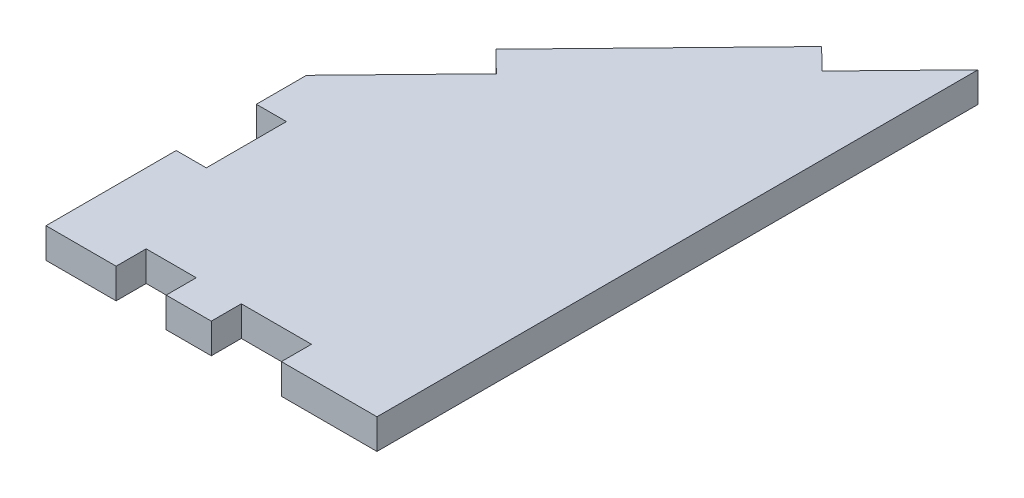
ISO-10303-21;
HEADER;
FILE_DESCRIPTION(('STEP AP214'),'2;1');
FILE_NAME('part.step','',(''),(''),'','','');
FILE_SCHEMA(('AUTOMOTIVE_DESIGN { 1 0 10303 214 1 1 1 1 }'));
ENDSEC;
DATA;
#1=APPLICATION_CONTEXT('core data for automotive mechanical design processes');
#2=APPLICATION_PROTOCOL_DEFINITION('international standard','automotive_design',2000,#1);
#3=PRODUCT_CONTEXT('',#1,'mechanical');
#4=PRODUCT('Part','Part','',(#3));
#5=PRODUCT_RELATED_PRODUCT_CATEGORY('part','',(#4));
#6=PRODUCT_DEFINITION_FORMATION('','',#4);
#7=PRODUCT_DEFINITION_CONTEXT('part definition',#1,'design');
#8=PRODUCT_DEFINITION('design','',#6,#7);
#9=PRODUCT_DEFINITION_SHAPE('','',#8);
#10=(LENGTH_UNIT() NAMED_UNIT(*) SI_UNIT(.MILLI.,.METRE.));
#11=(NAMED_UNIT(*) PLANE_ANGLE_UNIT() SI_UNIT($,.RADIAN.));
#12=(NAMED_UNIT(*) SI_UNIT($,.STERADIAN.) SOLID_ANGLE_UNIT());
#13=UNCERTAINTY_MEASURE_WITH_UNIT(LENGTH_MEASURE(1.E-05),#10,'distance_accuracy_value','');
#14=(GEOMETRIC_REPRESENTATION_CONTEXT(3) GLOBAL_UNCERTAINTY_ASSIGNED_CONTEXT((#13)) GLOBAL_UNIT_ASSIGNED_CONTEXT((#10,
#11,#12)) REPRESENTATION_CONTEXT('',''));
#15=CARTESIAN_POINT('',(0.,0.,0.));
#16=DIRECTION('',(0.,0.,1.));
#17=DIRECTION('',(1.,0.,0.));
#18=AXIS2_PLACEMENT_3D('',#15,#16,#17);
#19=CARTESIAN_POINT('',(1571.17156296441,3.,4124.17356938647));
#20=DIRECTION('',(1.,0.,0.));
#21=DIRECTION('',(0.,0.,-1.));
#22=AXIS2_PLACEMENT_3D('',#19,#20,#21);
#23=PLANE('',#22);
#24=DIRECTION('',(0.,0.,1.));
#25=VECTOR('',#24,1.);
#26=CARTESIAN_POINT('',(1571.17156296441,0.,4124.17356938647));
#27=LINE('',#26,#25);
#28=CARTESIAN_POINT('',(1571.17156296441,0.,4124.17356938647));
#29=VERTEX_POINT('',#28);
#30=CARTESIAN_POINT('',(1571.17156296441,0.,4137.17356938647));
#31=VERTEX_POINT('',#30);
#32=EDGE_CURVE('E200',#29,#31,#27,.T.);
#33=ORIENTED_EDGE('',*,*,#32,.T.);
#34=DIRECTION('',(0.,-1.,0.));
#35=VECTOR('',#34,1.);
#36=CARTESIAN_POINT('',(1571.17156296441,3.,4137.17356938647));
#37=LINE('',#36,#35);
#38=CARTESIAN_POINT('',(1571.17156296441,3.,4137.17356938647));
#39=VERTEX_POINT('',#38);
#40=EDGE_CURVE('E11',#39,#31,#37,.T.);
#41=ORIENTED_EDGE('',*,*,#40,.F.);
#42=DIRECTION('',(0.,0.,1.));
#43=VECTOR('',#42,1.);
#44=CARTESIAN_POINT('',(1571.17156296441,3.,4124.17356938647));
#45=LINE('',#44,#43);
#46=CARTESIAN_POINT('',(1571.17156296441,3.,4124.17356938647));
#47=VERTEX_POINT('',#46);
#48=EDGE_CURVE('E238',#47,#39,#45,.T.);
#49=ORIENTED_EDGE('',*,*,#48,.F.);
#50=DIRECTION('',(0.,-1.,0.));
#51=VECTOR('',#50,1.);
#52=CARTESIAN_POINT('',(1571.17156296441,3.,4124.17356938647));
#53=LINE('',#52,#51);
#54=EDGE_CURVE('E196',#47,#29,#53,.T.);
#55=ORIENTED_EDGE('',*,*,#54,.T.);
#56=EDGE_LOOP('',(#33,#41,#49,#55));
#57=FACE_BOUND('',#56,.T.);
#58=ADVANCED_FACE('F32',(#57),#23,.F.);
#59=CARTESIAN_POINT('',(1571.17156296441,3.,4137.17356938647));
#60=DIRECTION('',(0.,0.,-1.));
#61=DIRECTION('',(-1.,0.,0.));
#62=AXIS2_PLACEMENT_3D('',#59,#60,#61);
#63=PLANE('',#62);
#64=DIRECTION('',(1.,0.,0.));
#65=VECTOR('',#64,1.);
#66=CARTESIAN_POINT('',(1571.17156296441,0.,4137.17356938647));
#67=LINE('',#66,#65);
#68=CARTESIAN_POINT('',(1578.17156296441,0.,4137.17356938647));
#69=VERTEX_POINT('',#68);
#70=EDGE_CURVE('E203',#31,#69,#67,.T.);
#71=ORIENTED_EDGE('',*,*,#70,.T.);
#72=DIRECTION('',(0.,-1.,0.));
#73=VECTOR('',#72,1.);
#74=CARTESIAN_POINT('',(1578.17156296441,3.,4137.17356938647));
#75=LINE('',#74,#73);
#76=CARTESIAN_POINT('',(1578.17156296441,3.,4137.17356938647));
#77=VERTEX_POINT('',#76);
#78=EDGE_CURVE('E40',#77,#69,#75,.T.);
#79=ORIENTED_EDGE('',*,*,#78,.F.);
#80=DIRECTION('',(1.,0.,0.));
#81=VECTOR('',#80,1.);
#82=CARTESIAN_POINT('',(1571.17156296441,3.,4137.17356938647));
#83=LINE('',#82,#81);
#84=EDGE_CURVE('E127',#39,#77,#83,.T.);
#85=ORIENTED_EDGE('',*,*,#84,.F.);
#86=ORIENTED_EDGE('',*,*,#40,.T.);
#87=EDGE_LOOP('',(#71,#79,#85,#86));
#88=FACE_BOUND('',#87,.T.);
#89=ADVANCED_FACE('F356',(#88),#63,.F.);
#90=CARTESIAN_POINT('',(1578.17156296441,3.,4137.17356938647));
#91=DIRECTION('',(-1.,0.,0.));
#92=DIRECTION('',(0.,0.,1.));
#93=AXIS2_PLACEMENT_3D('',#90,#91,#92);
#94=PLANE('',#93);
#95=DIRECTION('',(0.,0.,-1.));
#96=VECTOR('',#95,1.);
#97=CARTESIAN_POINT('',(1578.17156296441,0.,4137.17356938647));
#98=LINE('',#97,#96);
#99=CARTESIAN_POINT('',(1578.17156296441,0.,4134.17356938647));
#100=VERTEX_POINT('',#99);
#101=EDGE_CURVE('E205',#69,#100,#98,.T.);
#102=ORIENTED_EDGE('',*,*,#101,.T.);
#103=DIRECTION('',(0.,-1.,0.));
#104=VECTOR('',#103,1.);
#105=CARTESIAN_POINT('',(1578.17156296441,3.,4134.17356938647));
#106=LINE('',#105,#104);
#107=CARTESIAN_POINT('',(1578.17156296441,3.,4134.17356938647));
#108=VERTEX_POINT('',#107);
#109=EDGE_CURVE('E281',#108,#100,#106,.T.);
#110=ORIENTED_EDGE('',*,*,#109,.F.);
#111=DIRECTION('',(0.,0.,-1.));
#112=VECTOR('',#111,1.);
#113=CARTESIAN_POINT('',(1578.17156296441,3.,4137.17356938647));
#114=LINE('',#113,#112);
#115=EDGE_CURVE('E289',#77,#108,#114,.T.);
#116=ORIENTED_EDGE('',*,*,#115,.F.);
#117=ORIENTED_EDGE('',*,*,#78,.T.);
#118=EDGE_LOOP('',(#102,#110,#116,#117));
#119=FACE_BOUND('',#118,.T.);
#120=ADVANCED_FACE('F287',(#119),#94,.F.);
#121=CARTESIAN_POINT('',(1578.17156296441,3.,4134.17356938647));
#122=DIRECTION('',(0.,0.,-1.));
#123=DIRECTION('',(-1.,0.,0.));
#124=AXIS2_PLACEMENT_3D('',#121,#122,#123);
#125=PLANE('',#124);
#126=DIRECTION('',(1.,0.,0.));
#127=VECTOR('',#126,1.);
#128=CARTESIAN_POINT('',(1578.17156296441,0.,4134.17356938647));
#129=LINE('',#128,#127);
#130=CARTESIAN_POINT('',(1583.17156296441,0.,4134.17356938647));
#131=VERTEX_POINT('',#130);
#132=EDGE_CURVE('E207',#100,#131,#129,.T.);
#133=ORIENTED_EDGE('',*,*,#132,.T.);
#134=DIRECTION('',(0.,-1.,0.));
#135=VECTOR('',#134,1.);
#136=CARTESIAN_POINT('',(1583.17156296441,3.,4134.17356938647));
#137=LINE('',#136,#135);
#138=CARTESIAN_POINT('',(1583.17156296441,3.,4134.17356938647));
#139=VERTEX_POINT('',#138);
#140=EDGE_CURVE('E278',#139,#131,#137,.T.);
#141=ORIENTED_EDGE('',*,*,#140,.F.);
#142=DIRECTION('',(1.,0.,0.));
#143=VECTOR('',#142,1.);
#144=CARTESIAN_POINT('',(1578.17156296441,3.,4134.17356938647));
#145=LINE('',#144,#143);
#146=EDGE_CURVE('E307',#108,#139,#145,.T.);
#147=ORIENTED_EDGE('',*,*,#146,.F.);
#148=ORIENTED_EDGE('',*,*,#109,.T.);
#149=EDGE_LOOP('',(#133,#141,#147,#148));
#150=FACE_BOUND('',#149,.T.);
#151=ADVANCED_FACE('F298',(#150),#125,.F.);
#152=CARTESIAN_POINT('',(1583.17156296441,3.,4134.17356938647));
#153=DIRECTION('',(1.,0.,0.));
#154=DIRECTION('',(0.,0.,-1.));
#155=AXIS2_PLACEMENT_3D('',#152,#153,#154);
#156=PLANE('',#155);
#157=DIRECTION('',(0.,0.,1.));
#158=VECTOR('',#157,1.);
#159=CARTESIAN_POINT('',(1583.17156296441,0.,4134.17356938647));
#160=LINE('',#159,#158);
#161=CARTESIAN_POINT('',(1583.17156296441,0.,4137.17356938647));
#162=VERTEX_POINT('',#161);
#163=EDGE_CURVE('E209',#131,#162,#160,.T.);
#164=ORIENTED_EDGE('',*,*,#163,.T.);
#165=DIRECTION('',(0.,-1.,0.));
#166=VECTOR('',#165,1.);
#167=CARTESIAN_POINT('',(1583.17156296441,3.,4137.17356938647));
#168=LINE('',#167,#166);
#169=CARTESIAN_POINT('',(1583.17156296441,3.,4137.17356938647));
#170=VERTEX_POINT('',#169);
#171=EDGE_CURVE('E275',#170,#162,#168,.T.);
#172=ORIENTED_EDGE('',*,*,#171,.F.);
#173=DIRECTION('',(0.,0.,1.));
#174=VECTOR('',#173,1.);
#175=CARTESIAN_POINT('',(1583.17156296441,3.,4134.17356938647));
#176=LINE('',#175,#174);
#177=EDGE_CURVE('E304',#139,#170,#176,.T.);
#178=ORIENTED_EDGE('',*,*,#177,.F.);
#179=ORIENTED_EDGE('',*,*,#140,.T.);
#180=EDGE_LOOP('',(#164,#172,#178,#179));
#181=FACE_BOUND('',#180,.T.);
#182=ADVANCED_FACE('F302',(#181),#156,.F.);
#183=CARTESIAN_POINT('',(1583.17156296441,3.,4137.17356938647));
#184=DIRECTION('',(0.,0.,-1.));
#185=DIRECTION('',(-1.,0.,0.));
#186=AXIS2_PLACEMENT_3D('',#183,#184,#185);
#187=PLANE('',#186);
#188=DIRECTION('',(1.,0.,0.));
#189=VECTOR('',#188,1.);
#190=CARTESIAN_POINT('',(1583.17156296441,0.,4137.17356938647));
#191=LINE('',#190,#189);
#192=CARTESIAN_POINT('',(1587.67156296441,0.,4137.17356938647));
#193=VERTEX_POINT('',#192);
#194=EDGE_CURVE('E211',#162,#193,#191,.T.);
#195=ORIENTED_EDGE('',*,*,#194,.T.);
#196=DIRECTION('',(0.,-1.,0.));
#197=VECTOR('',#196,1.);
#198=CARTESIAN_POINT('',(1587.67156296441,3.,4137.17356938647));
#199=LINE('',#198,#197);
#200=CARTESIAN_POINT('',(1587.67156296441,3.,4137.17356938647));
#201=VERTEX_POINT('',#200);
#202=EDGE_CURVE('E272',#201,#193,#199,.T.);
#203=ORIENTED_EDGE('',*,*,#202,.F.);
#204=DIRECTION('',(1.,0.,0.));
#205=VECTOR('',#204,1.);
#206=CARTESIAN_POINT('',(1583.17156296441,3.,4137.17356938647));
#207=LINE('',#206,#205);
#208=EDGE_CURVE('E306',#170,#201,#207,.T.);
#209=ORIENTED_EDGE('',*,*,#208,.F.);
#210=ORIENTED_EDGE('',*,*,#171,.T.);
#211=EDGE_LOOP('',(#195,#203,#209,#210));
#212=FACE_BOUND('',#211,.T.);
#213=ADVANCED_FACE('F369',(#212),#187,.F.);
#214=CARTESIAN_POINT('',(1587.67156296441,3.,4137.17356938647));
#215=DIRECTION('',(-1.,0.,0.));
#216=DIRECTION('',(0.,0.,1.));
#217=AXIS2_PLACEMENT_3D('',#214,#215,#216);
#218=PLANE('',#217);
#219=DIRECTION('',(0.,0.,-1.));
#220=VECTOR('',#219,1.);
#221=CARTESIAN_POINT('',(1587.67156296441,0.,4137.17356938647));
#222=LINE('',#221,#220);
#223=CARTESIAN_POINT('',(1587.67156296441,0.,4134.17356938647));
#224=VERTEX_POINT('',#223);
#225=EDGE_CURVE('E213',#193,#224,#222,.T.);
#226=ORIENTED_EDGE('',*,*,#225,.T.);
#227=DIRECTION('',(0.,-1.,0.));
#228=VECTOR('',#227,1.);
#229=CARTESIAN_POINT('',(1587.67156296441,3.,4134.17356938647));
#230=LINE('',#229,#228);
#231=CARTESIAN_POINT('',(1587.67156296441,3.,4134.17356938647));
#232=VERTEX_POINT('',#231);
#233=EDGE_CURVE('E269',#232,#224,#230,.T.);
#234=ORIENTED_EDGE('',*,*,#233,.F.);
#235=DIRECTION('',(0.,0.,-1.));
#236=VECTOR('',#235,1.);
#237=CARTESIAN_POINT('',(1587.67156296441,3.,4137.17356938647));
#238=LINE('',#237,#236);
#239=EDGE_CURVE('E309',#201,#232,#238,.T.);
#240=ORIENTED_EDGE('',*,*,#239,.F.);
#241=ORIENTED_EDGE('',*,*,#202,.T.);
#242=EDGE_LOOP('',(#226,#234,#240,#241));
#243=FACE_BOUND('',#242,.T.);
#244=ADVANCED_FACE('F372',(#243),#218,.F.);
#245=CARTESIAN_POINT('',(1587.67156296441,3.,4134.17356938647));
#246=DIRECTION('',(0.,0.,-1.));
#247=DIRECTION('',(-1.,0.,0.));
#248=AXIS2_PLACEMENT_3D('',#245,#246,#247);
#249=PLANE('',#248);
#250=DIRECTION('',(1.,0.,0.));
#251=VECTOR('',#250,1.);
#252=CARTESIAN_POINT('',(1587.67156296441,0.,4134.17356938647));
#253=LINE('',#252,#251);
#254=CARTESIAN_POINT('',(1594.67156296441,0.,4134.17356938647));
#255=VERTEX_POINT('',#254);
#256=EDGE_CURVE('E215',#224,#255,#253,.T.);
#257=ORIENTED_EDGE('',*,*,#256,.T.);
#258=DIRECTION('',(0.,-1.,0.));
#259=VECTOR('',#258,1.);
#260=CARTESIAN_POINT('',(1594.67156296441,3.,4134.17356938647));
#261=LINE('',#260,#259);
#262=CARTESIAN_POINT('',(1594.67156296441,3.,4134.17356938647));
#263=VERTEX_POINT('',#262);
#264=EDGE_CURVE('E266',#263,#255,#261,.T.);
#265=ORIENTED_EDGE('',*,*,#264,.F.);
#266=DIRECTION('',(1.,0.,0.));
#267=VECTOR('',#266,1.);
#268=CARTESIAN_POINT('',(1587.67156296441,3.,4134.17356938647));
#269=LINE('',#268,#267);
#270=EDGE_CURVE('E315',#232,#263,#269,.T.);
#271=ORIENTED_EDGE('',*,*,#270,.F.);
#272=ORIENTED_EDGE('',*,*,#233,.T.);
#273=EDGE_LOOP('',(#257,#265,#271,#272));
#274=FACE_BOUND('',#273,.T.);
#275=ADVANCED_FACE('F376',(#274),#249,.F.);
#276=CARTESIAN_POINT('',(1594.67156296441,3.,4134.17356938647));
#277=DIRECTION('',(1.,0.,0.));
#278=DIRECTION('',(0.,0.,-1.));
#279=AXIS2_PLACEMENT_3D('',#276,#277,#278);
#280=PLANE('',#279);
#281=DIRECTION('',(0.,0.,1.));
#282=VECTOR('',#281,1.);
#283=CARTESIAN_POINT('',(1594.67156296441,0.,4134.17356938647));
#284=LINE('',#283,#282);
#285=CARTESIAN_POINT('',(1594.67156296441,0.,4137.17356938647));
#286=VERTEX_POINT('',#285);
#287=EDGE_CURVE('E217',#255,#286,#284,.T.);
#288=ORIENTED_EDGE('',*,*,#287,.T.);
#289=DIRECTION('',(0.,-1.,0.));
#290=VECTOR('',#289,1.);
#291=CARTESIAN_POINT('',(1594.67156296441,3.,4137.17356938647));
#292=LINE('',#291,#290);
#293=CARTESIAN_POINT('',(1594.67156296441,3.,4137.17356938647));
#294=VERTEX_POINT('',#293);
#295=EDGE_CURVE('E263',#294,#286,#292,.T.);
#296=ORIENTED_EDGE('',*,*,#295,.F.);
#297=DIRECTION('',(0.,0.,1.));
#298=VECTOR('',#297,1.);
#299=CARTESIAN_POINT('',(1594.67156296441,3.,4134.17356938647));
#300=LINE('',#299,#298);
#301=EDGE_CURVE('E317',#263,#294,#300,.T.);
#302=ORIENTED_EDGE('',*,*,#301,.F.);
#303=ORIENTED_EDGE('',*,*,#264,.T.);
#304=EDGE_LOOP('',(#288,#296,#302,#303));
#305=FACE_BOUND('',#304,.T.);
#306=ADVANCED_FACE('F380',(#305),#280,.F.);
#307=CARTESIAN_POINT('',(1594.67156296441,3.,4137.17356938647));
#308=DIRECTION('',(0.,0.,-1.));
#309=DIRECTION('',(-1.,0.,0.));
#310=AXIS2_PLACEMENT_3D('',#307,#308,#309);
#311=PLANE('',#310);
#312=DIRECTION('',(1.,0.,0.));
#313=VECTOR('',#312,1.);
#314=CARTESIAN_POINT('',(1594.67156296441,0.,4137.17356938647));
#315=LINE('',#314,#313);
#316=CARTESIAN_POINT('',(1604.21156296441,0.,4137.17356938647));
#317=VERTEX_POINT('',#316);
#318=EDGE_CURVE('E219',#286,#317,#315,.T.);
#319=ORIENTED_EDGE('',*,*,#318,.T.);
#320=DIRECTION('',(0.,-1.,0.));
#321=VECTOR('',#320,1.);
#322=CARTESIAN_POINT('',(1604.21156296441,3.,4137.17356938647));
#323=LINE('',#322,#321);
#324=CARTESIAN_POINT('',(1604.21156296441,3.,4137.17356938647));
#325=VERTEX_POINT('',#324);
#326=EDGE_CURVE('E260',#325,#317,#323,.T.);
#327=ORIENTED_EDGE('',*,*,#326,.F.);
#328=DIRECTION('',(1.,0.,0.));
#329=VECTOR('',#328,1.);
#330=CARTESIAN_POINT('',(1594.67156296441,3.,4137.17356938647));
#331=LINE('',#330,#329);
#332=EDGE_CURVE('E319',#294,#325,#331,.T.);
#333=ORIENTED_EDGE('',*,*,#332,.F.);
#334=ORIENTED_EDGE('',*,*,#295,.T.);
#335=EDGE_LOOP('',(#319,#327,#333,#334));
#336=FACE_BOUND('',#335,.T.);
#337=ADVANCED_FACE('F384',(#336),#311,.F.);
#338=CARTESIAN_POINT('',(1604.21156296441,3.,4077.17356938647));
#339=DIRECTION('',(-1.,0.,0.));
#340=DIRECTION('',(0.,0.,1.));
#341=AXIS2_PLACEMENT_3D('',#338,#339,#340);
#342=PLANE('',#341);
#343=DIRECTION('',(0.,0.,-1.));
#344=VECTOR('',#343,1.);
#345=CARTESIAN_POINT('',(1604.21156296441,0.,4077.17356938647));
#346=LINE('',#345,#344);
#347=CARTESIAN_POINT('',(1604.21156296441,0.,4077.17356938647));
#348=VERTEX_POINT('',#347);
#349=EDGE_CURVE('E221',#317,#348,#346,.T.);
#350=ORIENTED_EDGE('',*,*,#349,.T.);
#351=DIRECTION('',(0.,-1.,0.));
#352=VECTOR('',#351,1.);
#353=CARTESIAN_POINT('',(1604.21156296441,3.,4077.17356938647));
#354=LINE('',#353,#352);
#355=CARTESIAN_POINT('',(1604.21156296441,3.,4077.17356938647));
#356=VERTEX_POINT('',#355);
#357=EDGE_CURVE('E257',#356,#348,#354,.T.);
#358=ORIENTED_EDGE('',*,*,#357,.F.);
#359=DIRECTION('',(0.,0.,-1.));
#360=VECTOR('',#359,1.);
#361=CARTESIAN_POINT('',(1604.21156296441,3.,4077.17356938647));
#362=LINE('',#361,#360);
#363=EDGE_CURVE('E321',#325,#356,#362,.T.);
#364=ORIENTED_EDGE('',*,*,#363,.F.);
#365=ORIENTED_EDGE('',*,*,#326,.T.);
#366=EDGE_LOOP('',(#350,#358,#364,#365));
#367=FACE_BOUND('',#366,.T.);
#368=ADVANCED_FACE('F388',(#367),#342,.F.);
#369=CARTESIAN_POINT('',(1604.21156296441,3.,4077.17356938647));
#370=DIRECTION('',(0.717158889853033,0.,0.696909697668762));
#371=DIRECTION('',(0.696909697668762,0.,-0.717158889853033));
#372=AXIS2_PLACEMENT_3D('',#369,#370,#371);
#373=PLANE('',#372);
#374=DIRECTION('',(-0.696909697668762,0.,0.717158889853033));
#375=VECTOR('',#374,1.);
#376=CARTESIAN_POINT('',(1604.21156296441,0.,4077.17356938647));
#377=LINE('',#376,#375);
#378=CARTESIAN_POINT('',(1596.54555629005,0.,4085.06231717486));
#379=VERTEX_POINT('',#378);
#380=EDGE_CURVE('E223',#348,#379,#377,.T.);
#381=ORIENTED_EDGE('',*,*,#380,.T.);
#382=DIRECTION('',(0.,-1.,0.));
#383=VECTOR('',#382,1.);
#384=CARTESIAN_POINT('',(1596.54555629005,3.,4085.06231717486));
#385=LINE('',#384,#383);
#386=CARTESIAN_POINT('',(1596.54555629005,3.,4085.06231717486));
#387=VERTEX_POINT('',#386);
#388=EDGE_CURVE('E254',#387,#379,#385,.T.);
#389=ORIENTED_EDGE('',*,*,#388,.F.);
#390=DIRECTION('',(-0.696909697668762,0.,0.717158889853033));
#391=VECTOR('',#390,1.);
#392=CARTESIAN_POINT('',(1604.21156296441,3.,4077.17356938647));
#393=LINE('',#392,#391);
#394=EDGE_CURVE('E323',#356,#387,#393,.T.);
#395=ORIENTED_EDGE('',*,*,#394,.F.);
#396=ORIENTED_EDGE('',*,*,#357,.T.);
#397=EDGE_LOOP('',(#381,#389,#395,#396));
#398=FACE_BOUND('',#397,.T.);
#399=ADVANCED_FACE('F392',(#398),#373,.F.);
#400=CARTESIAN_POINT('',(1594.39407962049,3.,4082.97158808185));
#401=DIRECTION('',(-0.69690969766887,0.,0.717158889852928));
#402=DIRECTION('',(0.717158889852928,0.,0.69690969766887));
#403=AXIS2_PLACEMENT_3D('',#400,#401,#402);
#404=PLANE('',#403);
#405=DIRECTION('',(-0.717158889852928,0.,-0.69690969766887));
#406=VECTOR('',#405,1.);
#407=CARTESIAN_POINT('',(1594.39407962049,0.,4082.97158808185));
#408=LINE('',#407,#406);
#409=CARTESIAN_POINT('',(1594.39407962049,0.,4082.97158808185));
#410=VERTEX_POINT('',#409);
#411=EDGE_CURVE('E225',#379,#410,#408,.T.);
#412=ORIENTED_EDGE('',*,*,#411,.T.);
#413=DIRECTION('',(0.,-1.,0.));
#414=VECTOR('',#413,1.);
#415=CARTESIAN_POINT('',(1594.39407962049,3.,4082.97158808185));
#416=LINE('',#415,#414);
#417=CARTESIAN_POINT('',(1594.39407962049,3.,4082.97158808185));
#418=VERTEX_POINT('',#417);
#419=EDGE_CURVE('E251',#418,#410,#416,.T.);
#420=ORIENTED_EDGE('',*,*,#419,.F.);
#421=DIRECTION('',(-0.717158889852928,0.,-0.69690969766887));
#422=VECTOR('',#421,1.);
#423=CARTESIAN_POINT('',(1594.39407962049,3.,4082.97158808185));
#424=LINE('',#423,#422);
#425=EDGE_CURVE('E325',#387,#418,#424,.T.);
#426=ORIENTED_EDGE('',*,*,#425,.F.);
#427=ORIENTED_EDGE('',*,*,#388,.T.);
#428=EDGE_LOOP('',(#412,#420,#426,#427));
#429=FACE_BOUND('',#428,.T.);
#430=ADVANCED_FACE('F396',(#429),#404,.F.);
#431=CARTESIAN_POINT('',(1578.36515657411,3.,4099.46624254847));
#432=DIRECTION('',(0.71715888985294,0.,0.696909697668858));
#433=DIRECTION('',(0.696909697668858,0.,-0.71715888985294));
#434=AXIS2_PLACEMENT_3D('',#431,#432,#433);
#435=PLANE('',#434);
#436=DIRECTION('',(-0.696909697668858,0.,0.71715888985294));
#437=VECTOR('',#436,1.);
#438=CARTESIAN_POINT('',(1578.36515657411,0.,4099.46624254847));
#439=LINE('',#438,#437);
#440=CARTESIAN_POINT('',(1578.36515657411,0.,4099.46624254847));
#441=VERTEX_POINT('',#440);
#442=EDGE_CURVE('E227',#410,#441,#439,.T.);
#443=ORIENTED_EDGE('',*,*,#442,.T.);
#444=DIRECTION('',(0.,-1.,0.));
#445=VECTOR('',#444,1.);
#446=CARTESIAN_POINT('',(1578.36515657411,3.,4099.46624254847));
#447=LINE('',#446,#445);
#448=CARTESIAN_POINT('',(1578.36515657411,3.,4099.46624254847));
#449=VERTEX_POINT('',#448);
#450=EDGE_CURVE('E248',#449,#441,#447,.T.);
#451=ORIENTED_EDGE('',*,*,#450,.F.);
#452=DIRECTION('',(-0.696909697668858,0.,0.71715888985294));
#453=VECTOR('',#452,1.);
#454=CARTESIAN_POINT('',(1578.36515657411,3.,4099.46624254847));
#455=LINE('',#454,#453);
#456=EDGE_CURVE('E327',#418,#449,#455,.T.);
#457=ORIENTED_EDGE('',*,*,#456,.F.);
#458=ORIENTED_EDGE('',*,*,#419,.T.);
#459=EDGE_LOOP('',(#443,#451,#457,#458));
#460=FACE_BOUND('',#459,.T.);
#461=ADVANCED_FACE('F400',(#460),#435,.F.);
#462=CARTESIAN_POINT('',(1580.51663324367,3.,4101.55697164148));
#463=DIRECTION('',(0.696909697668829,0.,-0.717158889852968));
#464=DIRECTION('',(-0.717158889852968,0.,-0.696909697668829));
#465=AXIS2_PLACEMENT_3D('',#462,#463,#464);
#466=PLANE('',#465);
#467=DIRECTION('',(0.717158889852968,0.,0.696909697668829));
#468=VECTOR('',#467,1.);
#469=CARTESIAN_POINT('',(1580.51663324367,0.,4101.55697164148));
#470=LINE('',#469,#468);
#471=CARTESIAN_POINT('',(1580.51663324367,0.,4101.55697164148));
#472=VERTEX_POINT('',#471);
#473=EDGE_CURVE('E229',#441,#472,#470,.T.);
#474=ORIENTED_EDGE('',*,*,#473,.T.);
#475=DIRECTION('',(0.,-1.,0.));
#476=VECTOR('',#475,1.);
#477=CARTESIAN_POINT('',(1580.51663324367,3.,4101.55697164148));
#478=LINE('',#477,#476);
#479=CARTESIAN_POINT('',(1580.51663324367,3.,4101.55697164148));
#480=VERTEX_POINT('',#479);
#481=EDGE_CURVE('E245',#480,#472,#478,.T.);
#482=ORIENTED_EDGE('',*,*,#481,.F.);
#483=DIRECTION('',(0.717158889852968,0.,0.696909697668829));
#484=VECTOR('',#483,1.);
#485=CARTESIAN_POINT('',(1580.51663324367,3.,4101.55697164148));
#486=LINE('',#485,#484);
#487=EDGE_CURVE('E329',#449,#480,#486,.T.);
#488=ORIENTED_EDGE('',*,*,#487,.F.);
#489=ORIENTED_EDGE('',*,*,#450,.T.);
#490=EDGE_LOOP('',(#474,#482,#488,#489));
#491=FACE_BOUND('',#490,.T.);
#492=ADVANCED_FACE('F404',(#491),#466,.F.);
#493=CARTESIAN_POINT('',(1580.51663324367,3.,4101.55697164148));
#494=DIRECTION('',(0.717158889852926,0.,0.696909697668872));
#495=DIRECTION('',(0.696909697668872,0.,-0.717158889852926));
#496=AXIS2_PLACEMENT_3D('',#493,#494,#495);
#497=PLANE('',#496);
#498=DIRECTION('',(-0.696909697668872,0.,0.717158889852926));
#499=VECTOR('',#498,1.);
#500=CARTESIAN_POINT('',(1580.51663324367,0.,4101.55697164148));
#501=LINE('',#500,#499);
#502=CARTESIAN_POINT('',(1571.17156296441,0.,4111.17356938647));
#503=VERTEX_POINT('',#502);
#504=EDGE_CURVE('E231',#472,#503,#501,.T.);
#505=ORIENTED_EDGE('',*,*,#504,.T.);
#506=DIRECTION('',(0.,-1.,0.));
#507=VECTOR('',#506,1.);
#508=CARTESIAN_POINT('',(1571.17156296441,3.,4111.17356938647));
#509=LINE('',#508,#507);
#510=CARTESIAN_POINT('',(1571.17156296441,3.,4111.17356938647));
#511=VERTEX_POINT('',#510);
#512=EDGE_CURVE('E242',#511,#503,#509,.T.);
#513=ORIENTED_EDGE('',*,*,#512,.F.);
#514=DIRECTION('',(-0.696909697668872,0.,0.717158889852926));
#515=VECTOR('',#514,1.);
#516=CARTESIAN_POINT('',(1580.51663324367,3.,4101.55697164148));
#517=LINE('',#516,#515);
#518=EDGE_CURVE('E331',#480,#511,#517,.T.);
#519=ORIENTED_EDGE('',*,*,#518,.F.);
#520=ORIENTED_EDGE('',*,*,#481,.T.);
#521=EDGE_LOOP('',(#505,#513,#519,#520));
#522=FACE_BOUND('',#521,.T.);
#523=ADVANCED_FACE('F337',(#522),#497,.F.);
#524=CARTESIAN_POINT('',(1571.17156296441,3.,4116.17356938647));
#525=DIRECTION('',(1.,0.,0.));
#526=DIRECTION('',(0.,0.,-1.));
#527=AXIS2_PLACEMENT_3D('',#524,#525,#526);
#528=PLANE('',#527);
#529=DIRECTION('',(0.,0.,1.));
#530=VECTOR('',#529,1.);
#531=CARTESIAN_POINT('',(1571.17156296441,0.,4116.17356938647));
#532=LINE('',#531,#530);
#533=CARTESIAN_POINT('',(1571.17156296441,0.,4116.17356938647));
#534=VERTEX_POINT('',#533);
#535=EDGE_CURVE('E233',#503,#534,#532,.T.);
#536=ORIENTED_EDGE('',*,*,#535,.T.);
#537=DIRECTION('',(0.,-1.,0.));
#538=VECTOR('',#537,1.);
#539=CARTESIAN_POINT('',(1571.17156296441,3.,4116.17356938647));
#540=LINE('',#539,#538);
#541=CARTESIAN_POINT('',(1571.17156296441,3.,4116.17356938647));
#542=VERTEX_POINT('',#541);
#543=EDGE_CURVE('E191',#542,#534,#540,.T.);
#544=ORIENTED_EDGE('',*,*,#543,.F.);
#545=DIRECTION('',(0.,0.,1.));
#546=VECTOR('',#545,1.);
#547=CARTESIAN_POINT('',(1571.17156296441,3.,4116.17356938647));
#548=LINE('',#547,#546);
#549=EDGE_CURVE('E182',#511,#542,#548,.T.);
#550=ORIENTED_EDGE('',*,*,#549,.F.);
#551=ORIENTED_EDGE('',*,*,#512,.T.);
#552=EDGE_LOOP('',(#536,#544,#550,#551));
#553=FACE_BOUND('',#552,.T.);
#554=ADVANCED_FACE('F341',(#553),#528,.F.);
#555=CARTESIAN_POINT('',(1574.17156296441,3.,4116.17356938647));
#556=DIRECTION('',(0.,0.,-1.));
#557=DIRECTION('',(-1.,0.,0.));
#558=AXIS2_PLACEMENT_3D('',#555,#556,#557);
#559=PLANE('',#558);
#560=DIRECTION('',(1.,0.,0.));
#561=VECTOR('',#560,1.);
#562=CARTESIAN_POINT('',(1574.17156296441,0.,4116.17356938647));
#563=LINE('',#562,#561);
#564=CARTESIAN_POINT('',(1574.17156296441,0.,4116.17356938647));
#565=VERTEX_POINT('',#564);
#566=EDGE_CURVE('E190',#534,#565,#563,.T.);
#567=ORIENTED_EDGE('',*,*,#566,.T.);
#568=DIRECTION('',(0.,-1.,0.));
#569=VECTOR('',#568,1.);
#570=CARTESIAN_POINT('',(1574.17156296441,3.,4116.17356938647));
#571=LINE('',#570,#569);
#572=CARTESIAN_POINT('',(1574.17156296441,3.,4116.17356938647));
#573=VERTEX_POINT('',#572);
#574=EDGE_CURVE('E187',#573,#565,#571,.T.);
#575=ORIENTED_EDGE('',*,*,#574,.F.);
#576=DIRECTION('',(1.,0.,0.));
#577=VECTOR('',#576,1.);
#578=CARTESIAN_POINT('',(1574.17156296441,3.,4116.17356938647));
#579=LINE('',#578,#577);
#580=EDGE_CURVE('E176',#542,#573,#579,.T.);
#581=ORIENTED_EDGE('',*,*,#580,.F.);
#582=ORIENTED_EDGE('',*,*,#543,.T.);
#583=EDGE_LOOP('',(#567,#575,#581,#582));
#584=FACE_BOUND('',#583,.T.);
#585=ADVANCED_FACE('F188',(#584),#559,.F.);
#586=CARTESIAN_POINT('',(1574.17156296441,3.,4124.17356938647));
#587=DIRECTION('',(1.,0.,0.));
#588=DIRECTION('',(0.,0.,-1.));
#589=AXIS2_PLACEMENT_3D('',#586,#587,#588);
#590=PLANE('',#589);
#591=DIRECTION('',(0.,0.,1.));
#592=VECTOR('',#591,1.);
#593=CARTESIAN_POINT('',(1574.17156296441,0.,4124.17356938647));
#594=LINE('',#593,#592);
#595=CARTESIAN_POINT('',(1574.17156296441,0.,4124.17356938647));
#596=VERTEX_POINT('',#595);
#597=EDGE_CURVE('E113',#565,#596,#594,.T.);
#598=ORIENTED_EDGE('',*,*,#597,.T.);
#599=DIRECTION('',(0.,-1.,0.));
#600=VECTOR('',#599,1.);
#601=CARTESIAN_POINT('',(1574.17156296441,3.,4124.17356938647));
#602=LINE('',#601,#600);
#603=CARTESIAN_POINT('',(1574.17156296441,3.,4124.17356938647));
#604=VERTEX_POINT('',#603);
#605=EDGE_CURVE('E192',#604,#596,#602,.T.);
#606=ORIENTED_EDGE('',*,*,#605,.F.);
#607=DIRECTION('',(0.,0.,1.));
#608=VECTOR('',#607,1.);
#609=CARTESIAN_POINT('',(1574.17156296441,3.,4124.17356938647));
#610=LINE('',#609,#608);
#611=EDGE_CURVE('E180',#573,#604,#610,.T.);
#612=ORIENTED_EDGE('',*,*,#611,.F.);
#613=ORIENTED_EDGE('',*,*,#574,.T.);
#614=EDGE_LOOP('',(#598,#606,#612,#613));
#615=FACE_BOUND('',#614,.T.);
#616=ADVANCED_FACE('F194',(#615),#590,.F.);
#617=CARTESIAN_POINT('',(1571.17156296441,3.,4124.17356938647));
#618=DIRECTION('',(0.,0.,1.));
#619=DIRECTION('',(1.,0.,0.));
#620=AXIS2_PLACEMENT_3D('',#617,#618,#619);
#621=PLANE('',#620);
#622=DIRECTION('',(-1.,0.,0.));
#623=VECTOR('',#622,1.);
#624=CARTESIAN_POINT('',(1571.17156296441,0.,4124.17356938647));
#625=LINE('',#624,#623);
#626=EDGE_CURVE('E119',#596,#29,#625,.T.);
#627=ORIENTED_EDGE('',*,*,#626,.T.);
#628=ORIENTED_EDGE('',*,*,#54,.F.);
#629=DIRECTION('',(-1.,0.,0.));
#630=VECTOR('',#629,1.);
#631=CARTESIAN_POINT('',(1571.17156296441,3.,4124.17356938647));
#632=LINE('',#631,#630);
#633=EDGE_CURVE('E48',#604,#47,#632,.T.);
#634=ORIENTED_EDGE('',*,*,#633,.F.);
#635=ORIENTED_EDGE('',*,*,#605,.T.);
#636=EDGE_LOOP('',(#627,#628,#634,#635));
#637=FACE_BOUND('',#636,.T.);
#638=ADVANCED_FACE('F345',(#637),#621,.F.);
#639=CARTESIAN_POINT('',(0.,3.,0.));
#640=DIRECTION('',(0.,1.,0.));
#641=DIRECTION('',(0.,0.,1.));
#642=AXIS2_PLACEMENT_3D('',#639,#640,#641);
#643=PLANE('',#642);
#644=ORIENTED_EDGE('',*,*,#48,.T.);
#645=ORIENTED_EDGE('',*,*,#84,.T.);
#646=ORIENTED_EDGE('',*,*,#115,.T.);
#647=ORIENTED_EDGE('',*,*,#146,.T.);
#648=ORIENTED_EDGE('',*,*,#177,.T.);
#649=ORIENTED_EDGE('',*,*,#208,.T.);
#650=ORIENTED_EDGE('',*,*,#239,.T.);
#651=ORIENTED_EDGE('',*,*,#270,.T.);
#652=ORIENTED_EDGE('',*,*,#301,.T.);
#653=ORIENTED_EDGE('',*,*,#332,.T.);
#654=ORIENTED_EDGE('',*,*,#363,.T.);
#655=ORIENTED_EDGE('',*,*,#394,.T.);
#656=ORIENTED_EDGE('',*,*,#425,.T.);
#657=ORIENTED_EDGE('',*,*,#456,.T.);
#658=ORIENTED_EDGE('',*,*,#487,.T.);
#659=ORIENTED_EDGE('',*,*,#518,.T.);
#660=ORIENTED_EDGE('',*,*,#549,.T.);
#661=ORIENTED_EDGE('',*,*,#580,.T.);
#662=ORIENTED_EDGE('',*,*,#611,.T.);
#663=ORIENTED_EDGE('',*,*,#633,.T.);
#664=EDGE_LOOP('',(#644,#645,#646,#647,#648,#649,#650,#651,#652,#653,#654,#655,#656,#657,#658,
#659,#660,#661,#662,#663));
#665=FACE_BOUND('',#664,.T.);
#666=ADVANCED_FACE('F178',(#665),#643,.T.);
#667=CARTESIAN_POINT('',(0.,0.,0.));
#668=DIRECTION('',(0.,1.,0.));
#669=DIRECTION('',(0.,0.,1.));
#670=AXIS2_PLACEMENT_3D('',#667,#668,#669);
#671=PLANE('',#670);
#672=ORIENTED_EDGE('',*,*,#32,.F.);
#673=ORIENTED_EDGE('',*,*,#626,.F.);
#674=ORIENTED_EDGE('',*,*,#597,.F.);
#675=ORIENTED_EDGE('',*,*,#566,.F.);
#676=ORIENTED_EDGE('',*,*,#535,.F.);
#677=ORIENTED_EDGE('',*,*,#504,.F.);
#678=ORIENTED_EDGE('',*,*,#473,.F.);
#679=ORIENTED_EDGE('',*,*,#442,.F.);
#680=ORIENTED_EDGE('',*,*,#411,.F.);
#681=ORIENTED_EDGE('',*,*,#380,.F.);
#682=ORIENTED_EDGE('',*,*,#349,.F.);
#683=ORIENTED_EDGE('',*,*,#318,.F.);
#684=ORIENTED_EDGE('',*,*,#287,.F.);
#685=ORIENTED_EDGE('',*,*,#256,.F.);
#686=ORIENTED_EDGE('',*,*,#225,.F.);
#687=ORIENTED_EDGE('',*,*,#194,.F.);
#688=ORIENTED_EDGE('',*,*,#163,.F.);
#689=ORIENTED_EDGE('',*,*,#132,.F.);
#690=ORIENTED_EDGE('',*,*,#101,.F.);
#691=ORIENTED_EDGE('',*,*,#70,.F.);
#692=EDGE_LOOP('',(#672,#673,#674,#675,#676,#677,#678,#679,#680,#681,#682,#683,#684,#685,#686,
#687,#688,#689,#690,#691));
#693=FACE_BOUND('',#692,.T.);
#694=ADVANCED_FACE('F293',(#693),#671,.F.);
#695=CLOSED_SHELL('',(#58,#89,#120,#151,#182,#213,#244,#275,#306,#337,#368,#399,#430,#461,#492,
#523,#554,#585,#616,#638,#666,#694));
#696=MANIFOLD_SOLID_BREP('B2',#695);
#697=ADVANCED_BREP_SHAPE_REPRESENTATION('',(#18,#696),#14);
#698=SHAPE_DEFINITION_REPRESENTATION(#9,#697);
ENDSEC;
END-ISO-10303-21;
